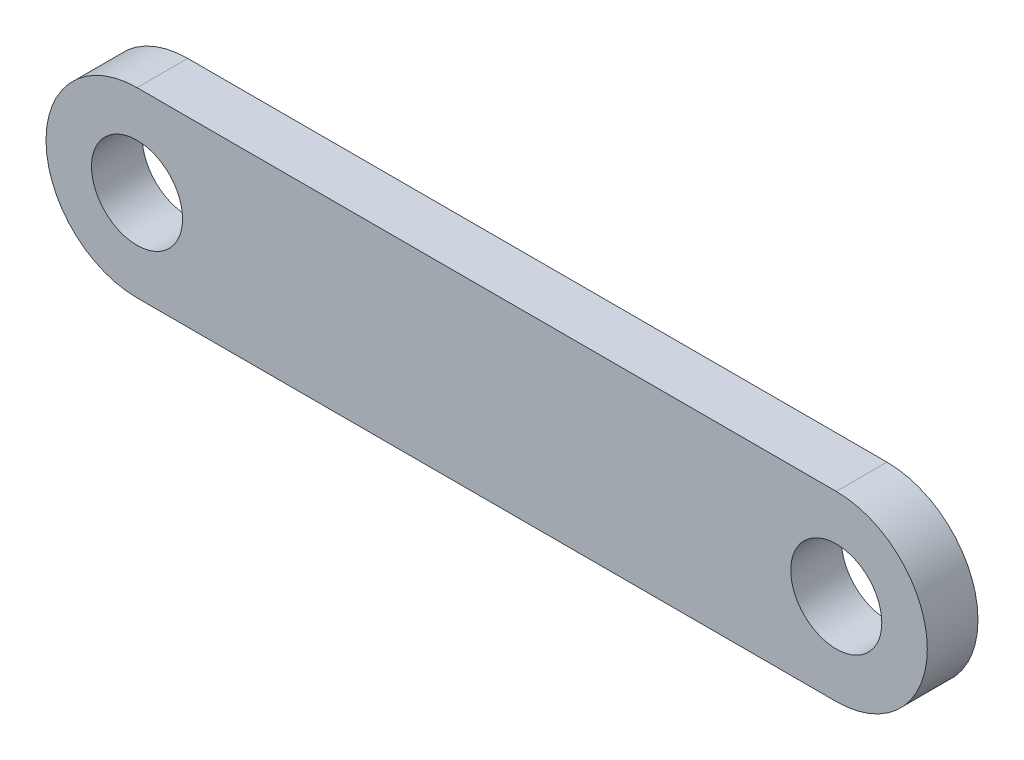
ISO-10303-21;
HEADER;
FILE_DESCRIPTION(('STEP AP214'),'2;1');
FILE_NAME('part.step','',(''),(''),'','','');
FILE_SCHEMA(('AUTOMOTIVE_DESIGN { 1 0 10303 214 1 1 1 1 }'));
ENDSEC;
DATA;
#1=APPLICATION_CONTEXT('core data for automotive mechanical design processes');
#2=APPLICATION_PROTOCOL_DEFINITION('international standard','automotive_design',2000,#1);
#3=PRODUCT_CONTEXT('',#1,'mechanical');
#4=PRODUCT('Part','Part','',(#3));
#5=PRODUCT_RELATED_PRODUCT_CATEGORY('part','',(#4));
#6=PRODUCT_DEFINITION_FORMATION('','',#4);
#7=PRODUCT_DEFINITION_CONTEXT('part definition',#1,'design');
#8=PRODUCT_DEFINITION('design','',#6,#7);
#9=PRODUCT_DEFINITION_SHAPE('','',#8);
#10=(LENGTH_UNIT() NAMED_UNIT(*) SI_UNIT(.MILLI.,.METRE.));
#11=(NAMED_UNIT(*) PLANE_ANGLE_UNIT() SI_UNIT($,.RADIAN.));
#12=(NAMED_UNIT(*) SI_UNIT($,.STERADIAN.) SOLID_ANGLE_UNIT());
#13=UNCERTAINTY_MEASURE_WITH_UNIT(LENGTH_MEASURE(1.E-05),#10,'distance_accuracy_value','');
#14=(GEOMETRIC_REPRESENTATION_CONTEXT(3) GLOBAL_UNCERTAINTY_ASSIGNED_CONTEXT((#13)) GLOBAL_UNIT_ASSIGNED_CONTEXT((#10,
#11,#12)) REPRESENTATION_CONTEXT('',''));
#15=CARTESIAN_POINT('',(0.,0.,0.));
#16=DIRECTION('',(0.,0.,1.));
#17=DIRECTION('',(1.,0.,0.));
#18=AXIS2_PLACEMENT_3D('',#15,#16,#17);
#19=CARTESIAN_POINT('',(0.,-8.98,5.));
#20=DIRECTION('',(0.,1.,0.));
#21=DIRECTION('',(-1.,0.,0.));
#22=AXIS2_PLACEMENT_3D('',#19,#20,#21);
#23=PLANE('',#22);
#24=DIRECTION('',(1.,0.,0.));
#25=VECTOR('',#24,1.);
#26=CARTESIAN_POINT('',(0.,-8.98,0.));
#27=LINE('',#26,#25);
#28=CARTESIAN_POINT('',(-34.49,-8.98,0.));
#29=VERTEX_POINT('',#28);
#30=CARTESIAN_POINT('',(34.49,-8.97999999999999,0.));
#31=VERTEX_POINT('',#30);
#32=EDGE_CURVE('E104',#29,#31,#27,.T.);
#33=ORIENTED_EDGE('',*,*,#32,.T.);
#34=DIRECTION('',(0.,0.,-1.));
#35=VECTOR('',#34,1.);
#36=CARTESIAN_POINT('',(34.49,-8.97999999999999,5.));
#37=LINE('',#36,#35);
#38=CARTESIAN_POINT('',(34.49,-8.97999999999999,5.));
#39=VERTEX_POINT('',#38);
#40=EDGE_CURVE('E11',#39,#31,#37,.T.);
#41=ORIENTED_EDGE('',*,*,#40,.F.);
#42=DIRECTION('',(1.,0.,0.));
#43=VECTOR('',#42,1.);
#44=CARTESIAN_POINT('',(0.,-8.98,5.));
#45=LINE('',#44,#43);
#46=CARTESIAN_POINT('',(-34.49,-8.98,5.));
#47=VERTEX_POINT('',#46);
#48=EDGE_CURVE('E83',#47,#39,#45,.T.);
#49=ORIENTED_EDGE('',*,*,#48,.F.);
#50=DIRECTION('',(0.,0.,-1.));
#51=VECTOR('',#50,1.);
#52=CARTESIAN_POINT('',(-34.49,-8.98,5.));
#53=LINE('',#52,#51);
#54=EDGE_CURVE('E103',#47,#29,#53,.T.);
#55=ORIENTED_EDGE('',*,*,#54,.T.);
#56=EDGE_LOOP('',(#33,#41,#49,#55));
#57=FACE_BOUND('',#56,.T.);
#58=ADVANCED_FACE('F35',(#57),#23,.F.);
#59=CARTESIAN_POINT('',(34.49,0.,5.));
#60=DIRECTION('',(0.,0.,-1.));
#61=DIRECTION('',(-1.,0.,0.));
#62=AXIS2_PLACEMENT_3D('',#59,#60,#61);
#63=CYLINDRICAL_SURFACE('',#62,8.98);
#64=CARTESIAN_POINT('',(34.49,0.,0.));
#65=DIRECTION('',(0.,0.,1.));
#66=DIRECTION('',(1.,0.,0.));
#67=AXIS2_PLACEMENT_3D('',#64,#65,#66);
#68=CIRCLE('',#67,8.98);
#69=CARTESIAN_POINT('',(34.49,8.98000000000002,0.));
#70=VERTEX_POINT('',#69);
#71=EDGE_CURVE('E88',#31,#70,#68,.T.);
#72=ORIENTED_EDGE('',*,*,#71,.T.);
#73=DIRECTION('',(0.,0.,-1.));
#74=VECTOR('',#73,1.);
#75=CARTESIAN_POINT('',(34.49,8.98000000000002,5.));
#76=LINE('',#75,#74);
#77=CARTESIAN_POINT('',(34.49,8.98000000000002,5.));
#78=VERTEX_POINT('',#77);
#79=EDGE_CURVE('E43',#78,#70,#76,.T.);
#80=ORIENTED_EDGE('',*,*,#79,.F.);
#81=CARTESIAN_POINT('',(34.49,0.,5.));
#82=DIRECTION('',(0.,0.,1.));
#83=DIRECTION('',(1.,0.,0.));
#84=AXIS2_PLACEMENT_3D('',#81,#82,#83);
#85=CIRCLE('',#84,8.98);
#86=EDGE_CURVE('E77',#39,#78,#85,.T.);
#87=ORIENTED_EDGE('',*,*,#86,.F.);
#88=ORIENTED_EDGE('',*,*,#40,.T.);
#89=EDGE_LOOP('',(#72,#80,#87,#88));
#90=FACE_BOUND('',#89,.T.);
#91=ADVANCED_FACE('F87',(#90),#63,.T.);
#92=CARTESIAN_POINT('',(0.,8.98000000000001,5.));
#93=DIRECTION('',(0.,1.,0.));
#94=DIRECTION('',(-1.,0.,0.));
#95=AXIS2_PLACEMENT_3D('',#92,#93,#94);
#96=PLANE('',#95);
#97=DIRECTION('',(1.,0.,0.));
#98=VECTOR('',#97,1.);
#99=CARTESIAN_POINT('',(0.,8.98000000000001,0.));
#100=LINE('',#99,#98);
#101=CARTESIAN_POINT('',(-34.49,8.98,0.));
#102=VERTEX_POINT('',#101);
#103=EDGE_CURVE('E108',#102,#70,#100,.T.);
#104=ORIENTED_EDGE('',*,*,#103,.F.);
#105=DIRECTION('',(0.,0.,-1.));
#106=VECTOR('',#105,1.);
#107=CARTESIAN_POINT('',(-34.49,8.98,5.));
#108=LINE('',#107,#106);
#109=CARTESIAN_POINT('',(-34.49,8.98,5.));
#110=VERTEX_POINT('',#109);
#111=EDGE_CURVE('E67',#110,#102,#108,.T.);
#112=ORIENTED_EDGE('',*,*,#111,.F.);
#113=DIRECTION('',(1.,0.,0.));
#114=VECTOR('',#113,1.);
#115=CARTESIAN_POINT('',(0.,8.98000000000001,5.));
#116=LINE('',#115,#114);
#117=EDGE_CURVE('E81',#110,#78,#116,.T.);
#118=ORIENTED_EDGE('',*,*,#117,.T.);
#119=ORIENTED_EDGE('',*,*,#79,.T.);
#120=EDGE_LOOP('',(#104,#112,#118,#119));
#121=FACE_BOUND('',#120,.T.);
#122=ADVANCED_FACE('F92',(#121),#96,.T.);
#123=CARTESIAN_POINT('',(-34.49,0.,5.));
#124=DIRECTION('',(0.,0.,-1.));
#125=DIRECTION('',(-1.,0.,0.));
#126=AXIS2_PLACEMENT_3D('',#123,#124,#125);
#127=CYLINDRICAL_SURFACE('',#126,4.49);
#128=CARTESIAN_POINT('',(-34.49,0.,5.));
#129=DIRECTION('',(0.,0.,1.));
#130=DIRECTION('',(1.,0.,0.));
#131=AXIS2_PLACEMENT_3D('',#128,#129,#130);
#132=CIRCLE('',#131,4.49);
#133=CARTESIAN_POINT('',(-30.,0.,5.));
#134=VERTEX_POINT('',#133);
#135=EDGE_CURVE('E94',#134,#134,#132,.T.);
#136=ORIENTED_EDGE('',*,*,#135,.T.);
#137=EDGE_LOOP('',(#136));
#138=FACE_BOUND('',#137,.T.);
#139=CARTESIAN_POINT('',(-34.49,0.,0.));
#140=DIRECTION('',(0.,0.,1.));
#141=DIRECTION('',(1.,0.,0.));
#142=AXIS2_PLACEMENT_3D('',#139,#140,#141);
#143=CIRCLE('',#142,4.49);
#144=CARTESIAN_POINT('',(-30.,0.,0.));
#145=VERTEX_POINT('',#144);
#146=EDGE_CURVE('E111',#145,#145,#143,.T.);
#147=ORIENTED_EDGE('',*,*,#146,.F.);
#148=EDGE_LOOP('',(#147));
#149=FACE_BOUND('',#148,.T.);
#150=ADVANCED_FACE('F139',(#138,#149),#127,.F.);
#151=CARTESIAN_POINT('',(-34.49,0.,5.));
#152=DIRECTION('',(0.,0.,-1.));
#153=DIRECTION('',(-1.,0.,0.));
#154=AXIS2_PLACEMENT_3D('',#151,#152,#153);
#155=CYLINDRICAL_SURFACE('',#154,8.98);
#156=CARTESIAN_POINT('',(-34.49,0.,0.));
#157=DIRECTION('',(0.,0.,1.));
#158=DIRECTION('',(1.,0.,0.));
#159=AXIS2_PLACEMENT_3D('',#156,#157,#158);
#160=CIRCLE('',#159,8.98);
#161=EDGE_CURVE('E70',#102,#29,#160,.T.);
#162=ORIENTED_EDGE('',*,*,#161,.T.);
#163=ORIENTED_EDGE('',*,*,#54,.F.);
#164=CARTESIAN_POINT('',(-34.49,0.,5.));
#165=DIRECTION('',(0.,0.,1.));
#166=DIRECTION('',(1.,0.,0.));
#167=AXIS2_PLACEMENT_3D('',#164,#165,#166);
#168=CIRCLE('',#167,8.98);
#169=EDGE_CURVE('E51',#110,#47,#168,.T.);
#170=ORIENTED_EDGE('',*,*,#169,.F.);
#171=ORIENTED_EDGE('',*,*,#111,.T.);
#172=EDGE_LOOP('',(#162,#163,#170,#171));
#173=FACE_BOUND('',#172,.T.);
#174=ADVANCED_FACE('F131',(#173),#155,.T.);
#175=CARTESIAN_POINT('',(34.49,0.,5.));
#176=DIRECTION('',(0.,0.,-1.));
#177=DIRECTION('',(-1.,0.,0.));
#178=AXIS2_PLACEMENT_3D('',#175,#176,#177);
#179=CYLINDRICAL_SURFACE('',#178,4.49);
#180=CARTESIAN_POINT('',(34.49,0.,5.));
#181=DIRECTION('',(0.,0.,1.));
#182=DIRECTION('',(1.,0.,0.));
#183=AXIS2_PLACEMENT_3D('',#180,#181,#182);
#184=CIRCLE('',#183,4.49);
#185=CARTESIAN_POINT('',(38.98,0.,5.));
#186=VERTEX_POINT('',#185);
#187=EDGE_CURVE('E100',#186,#186,#184,.T.);
#188=ORIENTED_EDGE('',*,*,#187,.T.);
#189=EDGE_LOOP('',(#188));
#190=FACE_BOUND('',#189,.T.);
#191=CARTESIAN_POINT('',(34.49,0.,0.));
#192=DIRECTION('',(0.,0.,1.));
#193=DIRECTION('',(1.,0.,0.));
#194=AXIS2_PLACEMENT_3D('',#191,#192,#193);
#195=CIRCLE('',#194,4.49);
#196=CARTESIAN_POINT('',(38.98,0.,0.));
#197=VERTEX_POINT('',#196);
#198=EDGE_CURVE('E114',#197,#197,#195,.T.);
#199=ORIENTED_EDGE('',*,*,#198,.F.);
#200=EDGE_LOOP('',(#199));
#201=FACE_BOUND('',#200,.T.);
#202=ADVANCED_FACE('F129',(#190,#201),#179,.F.);
#203=CARTESIAN_POINT('',(0.,0.,5.));
#204=DIRECTION('',(0.,0.,1.));
#205=DIRECTION('',(1.,0.,0.));
#206=AXIS2_PLACEMENT_3D('',#203,#204,#205);
#207=PLANE('',#206);
#208=ORIENTED_EDGE('',*,*,#48,.T.);
#209=ORIENTED_EDGE('',*,*,#86,.T.);
#210=ORIENTED_EDGE('',*,*,#117,.F.);
#211=ORIENTED_EDGE('',*,*,#169,.T.);
#212=EDGE_LOOP('',(#208,#209,#210,#211));
#213=FACE_BOUND('',#212,.T.);
#214=ORIENTED_EDGE('',*,*,#135,.F.);
#215=EDGE_LOOP('',(#214));
#216=FACE_BOUND('',#215,.T.);
#217=ORIENTED_EDGE('',*,*,#187,.F.);
#218=EDGE_LOOP('',(#217));
#219=FACE_BOUND('',#218,.T.);
#220=ADVANCED_FACE('F78',(#213,#216,#219),#207,.T.);
#221=CARTESIAN_POINT('',(0.,0.,0.));
#222=DIRECTION('',(0.,0.,1.));
#223=DIRECTION('',(1.,0.,0.));
#224=AXIS2_PLACEMENT_3D('',#221,#222,#223);
#225=PLANE('',#224);
#226=ORIENTED_EDGE('',*,*,#32,.F.);
#227=ORIENTED_EDGE('',*,*,#161,.F.);
#228=ORIENTED_EDGE('',*,*,#103,.T.);
#229=ORIENTED_EDGE('',*,*,#71,.F.);
#230=EDGE_LOOP('',(#226,#227,#228,#229));
#231=FACE_BOUND('',#230,.T.);
#232=ORIENTED_EDGE('',*,*,#146,.T.);
#233=EDGE_LOOP('',(#232));
#234=FACE_BOUND('',#233,.T.);
#235=ORIENTED_EDGE('',*,*,#198,.T.);
#236=EDGE_LOOP('',(#235));
#237=FACE_BOUND('',#236,.T.);
#238=ADVANCED_FACE('F121',(#231,#234,#237),#225,.F.);
#239=CLOSED_SHELL('',(#58,#91,#122,#150,#174,#202,#220,#238));
#240=MANIFOLD_SOLID_BREP('B2',#239);
#241=ADVANCED_BREP_SHAPE_REPRESENTATION('',(#18,#240),#14);
#242=SHAPE_DEFINITION_REPRESENTATION(#9,#241);
ENDSEC;
END-ISO-10303-21;
